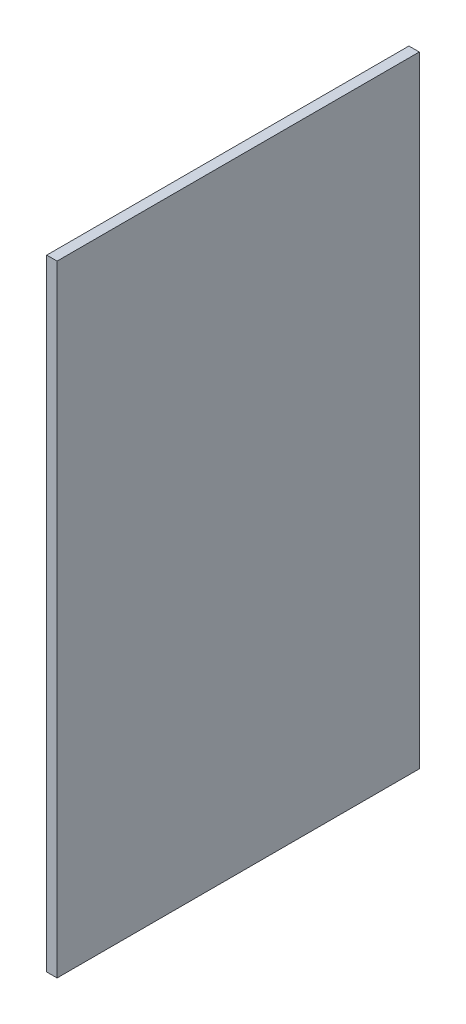
ISO-10303-21;
HEADER;
FILE_DESCRIPTION(('STEP AP214'),'2;1');
FILE_NAME('part.step','',(''),(''),'','','');
FILE_SCHEMA(('AUTOMOTIVE_DESIGN { 1 0 10303 214 1 1 1 1 }'));
ENDSEC;
DATA;
#1=APPLICATION_CONTEXT('core data for automotive mechanical design processes');
#2=APPLICATION_PROTOCOL_DEFINITION('international standard','automotive_design',2000,#1);
#3=PRODUCT_CONTEXT('',#1,'mechanical');
#4=PRODUCT('Part','Part','',(#3));
#5=PRODUCT_RELATED_PRODUCT_CATEGORY('part','',(#4));
#6=PRODUCT_DEFINITION_FORMATION('','',#4);
#7=PRODUCT_DEFINITION_CONTEXT('part definition',#1,'design');
#8=PRODUCT_DEFINITION('design','',#6,#7);
#9=PRODUCT_DEFINITION_SHAPE('','',#8);
#10=(LENGTH_UNIT() NAMED_UNIT(*) SI_UNIT(.MILLI.,.METRE.));
#11=(NAMED_UNIT(*) PLANE_ANGLE_UNIT() SI_UNIT($,.RADIAN.));
#12=(NAMED_UNIT(*) SI_UNIT($,.STERADIAN.) SOLID_ANGLE_UNIT());
#13=UNCERTAINTY_MEASURE_WITH_UNIT(LENGTH_MEASURE(1.E-05),#10,'distance_accuracy_value','');
#14=(GEOMETRIC_REPRESENTATION_CONTEXT(3) GLOBAL_UNCERTAINTY_ASSIGNED_CONTEXT((#13)) GLOBAL_UNIT_ASSIGNED_CONTEXT((#10,
#11,#12)) REPRESENTATION_CONTEXT('',''));
#15=CARTESIAN_POINT('',(0.,0.,0.));
#16=DIRECTION('',(0.,0.,1.));
#17=DIRECTION('',(1.,0.,0.));
#18=AXIS2_PLACEMENT_3D('',#15,#16,#17);
#19=CARTESIAN_POINT('',(-1.00000000000003,120.,35.));
#20=DIRECTION('',(0.,0.,-1.));
#21=DIRECTION('',(-1.,0.,0.));
#22=AXIS2_PLACEMENT_3D('',#19,#20,#21);
#23=PLANE('',#22);
#24=DIRECTION('',(1.,0.,0.));
#25=VECTOR('',#24,1.);
#26=CARTESIAN_POINT('',(-1.00000000000003,0.,35.));
#27=LINE('',#26,#25);
#28=CARTESIAN_POINT('',(-1.00000000000003,0.,35.));
#29=VERTEX_POINT('',#28);
#30=CARTESIAN_POINT('',(0.999999999999973,0.,35.));
#31=VERTEX_POINT('',#30);
#32=EDGE_CURVE('E107',#29,#31,#27,.T.);
#33=ORIENTED_EDGE('',*,*,#32,.T.);
#34=DIRECTION('',(0.,-1.,0.));
#35=VECTOR('',#34,1.);
#36=CARTESIAN_POINT('',(0.999999999999973,120.,35.));
#37=LINE('',#36,#35);
#38=CARTESIAN_POINT('',(0.999999999999973,120.,35.));
#39=VERTEX_POINT('',#38);
#40=EDGE_CURVE('E11',#39,#31,#37,.T.);
#41=ORIENTED_EDGE('',*,*,#40,.F.);
#42=DIRECTION('',(1.,0.,0.));
#43=VECTOR('',#42,1.);
#44=CARTESIAN_POINT('',(-1.00000000000003,120.,35.));
#45=LINE('',#44,#43);
#46=CARTESIAN_POINT('',(-1.00000000000003,120.,35.));
#47=VERTEX_POINT('',#46);
#48=EDGE_CURVE('E89',#47,#39,#45,.T.);
#49=ORIENTED_EDGE('',*,*,#48,.F.);
#50=DIRECTION('',(0.,-1.,0.));
#51=VECTOR('',#50,1.);
#52=CARTESIAN_POINT('',(-1.00000000000003,120.,35.));
#53=LINE('',#52,#51);
#54=EDGE_CURVE('E56',#47,#29,#53,.T.);
#55=ORIENTED_EDGE('',*,*,#54,.T.);
#56=EDGE_LOOP('',(#33,#41,#49,#55));
#57=FACE_BOUND('',#56,.T.);
#58=ADVANCED_FACE('F39',(#57),#23,.F.);
#59=CARTESIAN_POINT('',(0.999999999999973,120.,35.));
#60=DIRECTION('',(-1.,0.,0.));
#61=DIRECTION('',(0.,0.,1.));
#62=AXIS2_PLACEMENT_3D('',#59,#60,#61);
#63=PLANE('',#62);
#64=DIRECTION('',(0.,0.,-1.));
#65=VECTOR('',#64,1.);
#66=CARTESIAN_POINT('',(0.999999999999973,0.,35.));
#67=LINE('',#66,#65);
#68=CARTESIAN_POINT('',(0.999999999999973,0.,-35.));
#69=VERTEX_POINT('',#68);
#70=EDGE_CURVE('E95',#31,#69,#67,.T.);
#71=ORIENTED_EDGE('',*,*,#70,.T.);
#72=DIRECTION('',(0.,-1.,0.));
#73=VECTOR('',#72,1.);
#74=CARTESIAN_POINT('',(0.999999999999973,120.,-35.));
#75=LINE('',#74,#73);
#76=CARTESIAN_POINT('',(0.999999999999973,120.,-35.));
#77=VERTEX_POINT('',#76);
#78=EDGE_CURVE('E48',#77,#69,#75,.T.);
#79=ORIENTED_EDGE('',*,*,#78,.F.);
#80=DIRECTION('',(0.,0.,-1.));
#81=VECTOR('',#80,1.);
#82=CARTESIAN_POINT('',(0.999999999999973,120.,35.));
#83=LINE('',#82,#81);
#84=EDGE_CURVE('E81',#39,#77,#83,.T.);
#85=ORIENTED_EDGE('',*,*,#84,.F.);
#86=ORIENTED_EDGE('',*,*,#40,.T.);
#87=EDGE_LOOP('',(#71,#79,#85,#86));
#88=FACE_BOUND('',#87,.T.);
#89=ADVANCED_FACE('F94',(#88),#63,.F.);
#90=CARTESIAN_POINT('',(-1.00000000000003,120.,-35.));
#91=DIRECTION('',(0.,0.,-1.));
#92=DIRECTION('',(-1.,0.,0.));
#93=AXIS2_PLACEMENT_3D('',#90,#91,#92);
#94=PLANE('',#93);
#95=DIRECTION('',(1.,0.,0.));
#96=VECTOR('',#95,1.);
#97=CARTESIAN_POINT('',(-1.00000000000003,0.,-35.));
#98=LINE('',#97,#96);
#99=CARTESIAN_POINT('',(-1.00000000000003,0.,-35.));
#100=VERTEX_POINT('',#99);
#101=EDGE_CURVE('E112',#100,#69,#98,.T.);
#102=ORIENTED_EDGE('',*,*,#101,.F.);
#103=DIRECTION('',(0.,-1.,0.));
#104=VECTOR('',#103,1.);
#105=CARTESIAN_POINT('',(-1.00000000000003,120.,-35.));
#106=LINE('',#105,#104);
#107=CARTESIAN_POINT('',(-1.00000000000003,120.,-35.));
#108=VERTEX_POINT('',#107);
#109=EDGE_CURVE('E70',#108,#100,#106,.T.);
#110=ORIENTED_EDGE('',*,*,#109,.F.);
#111=DIRECTION('',(1.,0.,0.));
#112=VECTOR('',#111,1.);
#113=CARTESIAN_POINT('',(-1.00000000000003,120.,-35.));
#114=LINE('',#113,#112);
#115=EDGE_CURVE('E88',#108,#77,#114,.T.);
#116=ORIENTED_EDGE('',*,*,#115,.T.);
#117=ORIENTED_EDGE('',*,*,#78,.T.);
#118=EDGE_LOOP('',(#102,#110,#116,#117));
#119=FACE_BOUND('',#118,.T.);
#120=ADVANCED_FACE('F99',(#119),#94,.T.);
#121=CARTESIAN_POINT('',(-1.00000000000003,120.,35.));
#122=DIRECTION('',(-1.,0.,0.));
#123=DIRECTION('',(0.,0.,1.));
#124=AXIS2_PLACEMENT_3D('',#121,#122,#123);
#125=PLANE('',#124);
#126=DIRECTION('',(0.,0.,-1.));
#127=VECTOR('',#126,1.);
#128=CARTESIAN_POINT('',(-1.00000000000003,0.,35.));
#129=LINE('',#128,#127);
#130=EDGE_CURVE('E115',#29,#100,#129,.T.);
#131=ORIENTED_EDGE('',*,*,#130,.F.);
#132=ORIENTED_EDGE('',*,*,#54,.F.);
#133=DIRECTION('',(0.,0.,-1.));
#134=VECTOR('',#133,1.);
#135=CARTESIAN_POINT('',(-1.00000000000003,120.,35.));
#136=LINE('',#135,#134);
#137=EDGE_CURVE('E101',#47,#108,#136,.T.);
#138=ORIENTED_EDGE('',*,*,#137,.T.);
#139=ORIENTED_EDGE('',*,*,#109,.T.);
#140=EDGE_LOOP('',(#131,#132,#138,#139));
#141=FACE_BOUND('',#140,.T.);
#142=ADVANCED_FACE('F125',(#141),#125,.T.);
#143=CARTESIAN_POINT('',(0.,120.,0.));
#144=DIRECTION('',(0.,1.,0.));
#145=DIRECTION('',(0.,0.,1.));
#146=AXIS2_PLACEMENT_3D('',#143,#144,#145);
#147=PLANE('',#146);
#148=ORIENTED_EDGE('',*,*,#48,.T.);
#149=ORIENTED_EDGE('',*,*,#84,.T.);
#150=ORIENTED_EDGE('',*,*,#115,.F.);
#151=ORIENTED_EDGE('',*,*,#137,.F.);
#152=EDGE_LOOP('',(#148,#149,#150,#151));
#153=FACE_BOUND('',#152,.T.);
#154=ADVANCED_FACE('F85',(#153),#147,.T.);
#155=CARTESIAN_POINT('',(0.,0.,0.));
#156=DIRECTION('',(0.,1.,0.));
#157=DIRECTION('',(0.,0.,1.));
#158=AXIS2_PLACEMENT_3D('',#155,#156,#157);
#159=PLANE('',#158);
#160=ORIENTED_EDGE('',*,*,#32,.F.);
#161=ORIENTED_EDGE('',*,*,#130,.T.);
#162=ORIENTED_EDGE('',*,*,#101,.T.);
#163=ORIENTED_EDGE('',*,*,#70,.F.);
#164=EDGE_LOOP('',(#160,#161,#162,#163));
#165=FACE_BOUND('',#164,.T.);
#166=ADVANCED_FACE('F124',(#165),#159,.F.);
#167=CLOSED_SHELL('',(#58,#89,#120,#142,#154,#166));
#168=MANIFOLD_SOLID_BREP('B2',#167);
#169=ADVANCED_BREP_SHAPE_REPRESENTATION('',(#18,#168),#14);
#170=SHAPE_DEFINITION_REPRESENTATION(#9,#169);
ENDSEC;
END-ISO-10303-21;
